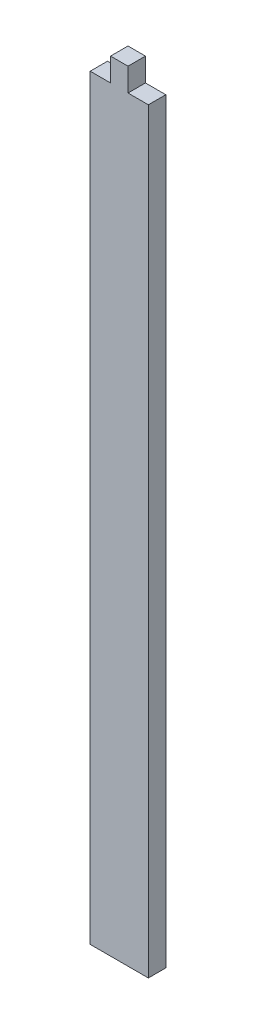
ISO-10303-21;
HEADER;
FILE_DESCRIPTION(('STEP AP214'),'2;1');
FILE_NAME('part.step','',(''),(''),'','','');
FILE_SCHEMA(('AUTOMOTIVE_DESIGN { 1 0 10303 214 1 1 1 1 }'));
ENDSEC;
DATA;
#1=APPLICATION_CONTEXT('core data for automotive mechanical design processes');
#2=APPLICATION_PROTOCOL_DEFINITION('international standard','automotive_design',2000,#1);
#3=PRODUCT_CONTEXT('',#1,'mechanical');
#4=PRODUCT('Part','Part','',(#3));
#5=PRODUCT_RELATED_PRODUCT_CATEGORY('part','',(#4));
#6=PRODUCT_DEFINITION_FORMATION('','',#4);
#7=PRODUCT_DEFINITION_CONTEXT('part definition',#1,'design');
#8=PRODUCT_DEFINITION('design','',#6,#7);
#9=PRODUCT_DEFINITION_SHAPE('','',#8);
#10=(LENGTH_UNIT() NAMED_UNIT(*) SI_UNIT(.MILLI.,.METRE.));
#11=(NAMED_UNIT(*) PLANE_ANGLE_UNIT() SI_UNIT($,.RADIAN.));
#12=(NAMED_UNIT(*) SI_UNIT($,.STERADIAN.) SOLID_ANGLE_UNIT());
#13=UNCERTAINTY_MEASURE_WITH_UNIT(LENGTH_MEASURE(1.E-05),#10,'distance_accuracy_value','');
#14=(GEOMETRIC_REPRESENTATION_CONTEXT(3) GLOBAL_UNCERTAINTY_ASSIGNED_CONTEXT((#13)) GLOBAL_UNIT_ASSIGNED_CONTEXT((#10,
#11,#12)) REPRESENTATION_CONTEXT('',''));
#15=CARTESIAN_POINT('',(0.,0.,0.));
#16=DIRECTION('',(0.,0.,1.));
#17=DIRECTION('',(1.,0.,0.));
#18=AXIS2_PLACEMENT_3D('',#15,#16,#17);
#19=CARTESIAN_POINT('',(4.99999999999999,64.9999999999999,1.5));
#20=DIRECTION('',(-1.,0.,0.));
#21=DIRECTION('',(0.,-1.,0.));
#22=AXIS2_PLACEMENT_3D('',#19,#20,#21);
#23=PLANE('',#22);
#24=DIRECTION('',(0.,1.,0.));
#25=VECTOR('',#24,1.);
#26=CARTESIAN_POINT('',(4.99999999999999,64.9999999999999,-1.5));
#27=LINE('',#26,#25);
#28=CARTESIAN_POINT('',(5.00000000000001,-65.0000000000001,-1.5));
#29=VERTEX_POINT('',#28);
#30=CARTESIAN_POINT('',(4.99999999999999,64.9999999999999,-1.5));
#31=VERTEX_POINT('',#30);
#32=EDGE_CURVE('E129',#29,#31,#27,.T.);
#33=ORIENTED_EDGE('',*,*,#32,.T.);
#34=DIRECTION('',(0.,0.,-1.));
#35=VECTOR('',#34,1.);
#36=CARTESIAN_POINT('',(4.99999999999999,64.9999999999999,1.5));
#37=LINE('',#36,#35);
#38=CARTESIAN_POINT('',(4.99999999999999,64.9999999999999,1.5));
#39=VERTEX_POINT('',#38);
#40=EDGE_CURVE('E11',#39,#31,#37,.T.);
#41=ORIENTED_EDGE('',*,*,#40,.F.);
#42=DIRECTION('',(0.,1.,0.));
#43=VECTOR('',#42,1.);
#44=CARTESIAN_POINT('',(4.99999999999999,64.9999999999999,1.5));
#45=LINE('',#44,#43);
#46=CARTESIAN_POINT('',(5.00000000000001,-65.0000000000001,1.5));
#47=VERTEX_POINT('',#46);
#48=EDGE_CURVE('E143',#47,#39,#45,.T.);
#49=ORIENTED_EDGE('',*,*,#48,.F.);
#50=DIRECTION('',(0.,0.,-1.));
#51=VECTOR('',#50,1.);
#52=CARTESIAN_POINT('',(5.00000000000001,-65.0000000000001,1.5));
#53=LINE('',#52,#51);
#54=EDGE_CURVE('E125',#47,#29,#53,.T.);
#55=ORIENTED_EDGE('',*,*,#54,.T.);
#56=EDGE_LOOP('',(#33,#41,#49,#55));
#57=FACE_BOUND('',#56,.T.);
#58=ADVANCED_FACE('F33',(#57),#23,.F.);
#59=CARTESIAN_POINT('',(1.49999999999999,64.9999999999999,1.5));
#60=DIRECTION('',(0.,-1.,0.));
#61=DIRECTION('',(0.,0.,-1.));
#62=AXIS2_PLACEMENT_3D('',#59,#60,#61);
#63=PLANE('',#62);
#64=DIRECTION('',(-1.,0.,0.));
#65=VECTOR('',#64,1.);
#66=CARTESIAN_POINT('',(1.49999999999999,64.9999999999999,-1.5));
#67=LINE('',#66,#65);
#68=CARTESIAN_POINT('',(1.49999999999999,64.9999999999999,-1.5));
#69=VERTEX_POINT('',#68);
#70=EDGE_CURVE('E132',#31,#69,#67,.T.);
#71=ORIENTED_EDGE('',*,*,#70,.T.);
#72=DIRECTION('',(0.,0.,-1.));
#73=VECTOR('',#72,1.);
#74=CARTESIAN_POINT('',(1.49999999999999,64.9999999999999,1.5));
#75=LINE('',#74,#73);
#76=CARTESIAN_POINT('',(1.49999999999999,64.9999999999999,1.5));
#77=VERTEX_POINT('',#76);
#78=EDGE_CURVE('E41',#77,#69,#75,.T.);
#79=ORIENTED_EDGE('',*,*,#78,.F.);
#80=DIRECTION('',(-1.,0.,0.));
#81=VECTOR('',#80,1.);
#82=CARTESIAN_POINT('',(1.49999999999999,64.9999999999999,1.5));
#83=LINE('',#82,#81);
#84=EDGE_CURVE('E92',#39,#77,#83,.T.);
#85=ORIENTED_EDGE('',*,*,#84,.F.);
#86=ORIENTED_EDGE('',*,*,#40,.T.);
#87=EDGE_LOOP('',(#71,#79,#85,#86));
#88=FACE_BOUND('',#87,.T.);
#89=ADVANCED_FACE('F178',(#88),#63,.F.);
#90=CARTESIAN_POINT('',(1.49999999999999,64.9999999999999,1.5));
#91=DIRECTION('',(-1.,0.,0.));
#92=DIRECTION('',(0.,0.,1.));
#93=AXIS2_PLACEMENT_3D('',#90,#91,#92);
#94=PLANE('',#93);
#95=DIRECTION('',(0.,1.,0.));
#96=VECTOR('',#95,1.);
#97=CARTESIAN_POINT('',(1.49999999999999,64.9999999999999,-1.5));
#98=LINE('',#97,#96);
#99=CARTESIAN_POINT('',(1.49999999999999,68.9999999999999,-1.5));
#100=VERTEX_POINT('',#99);
#101=EDGE_CURVE('E134',#69,#100,#98,.T.);
#102=ORIENTED_EDGE('',*,*,#101,.T.);
#103=DIRECTION('',(0.,0.,-1.));
#104=VECTOR('',#103,1.);
#105=CARTESIAN_POINT('',(1.49999999999999,68.9999999999999,1.5));
#106=LINE('',#105,#104);
#107=CARTESIAN_POINT('',(1.49999999999999,68.9999999999999,1.5));
#108=VERTEX_POINT('',#107);
#109=EDGE_CURVE('E150',#108,#100,#106,.T.);
#110=ORIENTED_EDGE('',*,*,#109,.F.);
#111=DIRECTION('',(0.,1.,0.));
#112=VECTOR('',#111,1.);
#113=CARTESIAN_POINT('',(1.49999999999999,64.9999999999999,1.5));
#114=LINE('',#113,#112);
#115=EDGE_CURVE('E158',#77,#108,#114,.T.);
#116=ORIENTED_EDGE('',*,*,#115,.F.);
#117=ORIENTED_EDGE('',*,*,#78,.T.);
#118=EDGE_LOOP('',(#102,#110,#116,#117));
#119=FACE_BOUND('',#118,.T.);
#120=ADVANCED_FACE('F156',(#119),#94,.F.);
#121=CARTESIAN_POINT('',(-1.50000000000001,68.9999999999999,1.5));
#122=DIRECTION('',(0.,-1.,0.));
#123=DIRECTION('',(0.,0.,-1.));
#124=AXIS2_PLACEMENT_3D('',#121,#122,#123);
#125=PLANE('',#124);
#126=DIRECTION('',(-1.,0.,0.));
#127=VECTOR('',#126,1.);
#128=CARTESIAN_POINT('',(-1.50000000000001,68.9999999999999,-1.5));
#129=LINE('',#128,#127);
#130=CARTESIAN_POINT('',(-1.50000000000001,68.9999999999999,-1.5));
#131=VERTEX_POINT('',#130);
#132=EDGE_CURVE('E136',#100,#131,#129,.T.);
#133=ORIENTED_EDGE('',*,*,#132,.T.);
#134=DIRECTION('',(0.,0.,-1.));
#135=VECTOR('',#134,1.);
#136=CARTESIAN_POINT('',(-1.50000000000001,68.9999999999999,1.5));
#137=LINE('',#136,#135);
#138=CARTESIAN_POINT('',(-1.50000000000001,68.9999999999999,1.5));
#139=VERTEX_POINT('',#138);
#140=EDGE_CURVE('E147',#139,#131,#137,.T.);
#141=ORIENTED_EDGE('',*,*,#140,.F.);
#142=DIRECTION('',(-1.,0.,0.));
#143=VECTOR('',#142,1.);
#144=CARTESIAN_POINT('',(-1.50000000000001,68.9999999999999,1.5));
#145=LINE('',#144,#143);
#146=EDGE_CURVE('E170',#108,#139,#145,.T.);
#147=ORIENTED_EDGE('',*,*,#146,.F.);
#148=ORIENTED_EDGE('',*,*,#109,.T.);
#149=EDGE_LOOP('',(#133,#141,#147,#148));
#150=FACE_BOUND('',#149,.T.);
#151=ADVANCED_FACE('F166',(#150),#125,.F.);
#152=CARTESIAN_POINT('',(-1.50000000000001,64.9999999999999,1.5));
#153=DIRECTION('',(1.,0.,0.));
#154=DIRECTION('',(0.,0.,-1.));
#155=AXIS2_PLACEMENT_3D('',#152,#153,#154);
#156=PLANE('',#155);
#157=DIRECTION('',(0.,-1.,0.));
#158=VECTOR('',#157,1.);
#159=CARTESIAN_POINT('',(-1.50000000000001,64.9999999999999,-1.5));
#160=LINE('',#159,#158);
#161=CARTESIAN_POINT('',(-1.50000000000001,64.9999999999999,-1.5));
#162=VERTEX_POINT('',#161);
#163=EDGE_CURVE('E138',#131,#162,#160,.T.);
#164=ORIENTED_EDGE('',*,*,#163,.T.);
#165=DIRECTION('',(0.,0.,-1.));
#166=VECTOR('',#165,1.);
#167=CARTESIAN_POINT('',(-1.50000000000001,64.9999999999999,1.5));
#168=LINE('',#167,#166);
#169=CARTESIAN_POINT('',(-1.50000000000001,64.9999999999999,1.5));
#170=VERTEX_POINT('',#169);
#171=EDGE_CURVE('E120',#170,#162,#168,.T.);
#172=ORIENTED_EDGE('',*,*,#171,.F.);
#173=DIRECTION('',(0.,-1.,0.));
#174=VECTOR('',#173,1.);
#175=CARTESIAN_POINT('',(-1.50000000000001,64.9999999999999,1.5));
#176=LINE('',#175,#174);
#177=EDGE_CURVE('E111',#139,#170,#176,.T.);
#178=ORIENTED_EDGE('',*,*,#177,.F.);
#179=ORIENTED_EDGE('',*,*,#140,.T.);
#180=EDGE_LOOP('',(#164,#172,#178,#179));
#181=FACE_BOUND('',#180,.T.);
#182=ADVANCED_FACE('F169',(#181),#156,.F.);
#183=CARTESIAN_POINT('',(-5.00000000000001,64.9999999999999,1.5));
#184=DIRECTION('',(0.,-1.,0.));
#185=DIRECTION('',(0.,0.,-1.));
#186=AXIS2_PLACEMENT_3D('',#183,#184,#185);
#187=PLANE('',#186);
#188=DIRECTION('',(-1.,0.,0.));
#189=VECTOR('',#188,1.);
#190=CARTESIAN_POINT('',(-5.00000000000001,64.9999999999999,-1.5));
#191=LINE('',#190,#189);
#192=CARTESIAN_POINT('',(-5.00000000000001,64.9999999999999,-1.5));
#193=VERTEX_POINT('',#192);
#194=EDGE_CURVE('E119',#162,#193,#191,.T.);
#195=ORIENTED_EDGE('',*,*,#194,.T.);
#196=DIRECTION('',(0.,0.,-1.));
#197=VECTOR('',#196,1.);
#198=CARTESIAN_POINT('',(-5.00000000000001,64.9999999999999,1.5));
#199=LINE('',#198,#197);
#200=CARTESIAN_POINT('',(-5.00000000000001,64.9999999999999,1.5));
#201=VERTEX_POINT('',#200);
#202=EDGE_CURVE('E116',#201,#193,#199,.T.);
#203=ORIENTED_EDGE('',*,*,#202,.F.);
#204=DIRECTION('',(-1.,0.,0.));
#205=VECTOR('',#204,1.);
#206=CARTESIAN_POINT('',(-5.00000000000001,64.9999999999999,1.5));
#207=LINE('',#206,#205);
#208=EDGE_CURVE('E105',#170,#201,#207,.T.);
#209=ORIENTED_EDGE('',*,*,#208,.F.);
#210=ORIENTED_EDGE('',*,*,#171,.T.);
#211=EDGE_LOOP('',(#195,#203,#209,#210));
#212=FACE_BOUND('',#211,.T.);
#213=ADVANCED_FACE('F117',(#212),#187,.F.);
#214=CARTESIAN_POINT('',(-5.00000000000001,64.9999999999999,1.5));
#215=DIRECTION('',(1.,0.,0.));
#216=DIRECTION('',(0.,1.,0.));
#217=AXIS2_PLACEMENT_3D('',#214,#215,#216);
#218=PLANE('',#217);
#219=DIRECTION('',(0.,-1.,0.));
#220=VECTOR('',#219,1.);
#221=CARTESIAN_POINT('',(-5.00000000000001,64.9999999999999,-1.5));
#222=LINE('',#221,#220);
#223=CARTESIAN_POINT('',(-4.99999999999999,-65.0000000000001,-1.5));
#224=VERTEX_POINT('',#223);
#225=EDGE_CURVE('E78',#193,#224,#222,.T.);
#226=ORIENTED_EDGE('',*,*,#225,.T.);
#227=DIRECTION('',(0.,0.,-1.));
#228=VECTOR('',#227,1.);
#229=CARTESIAN_POINT('',(-4.99999999999999,-65.0000000000001,1.5));
#230=LINE('',#229,#228);
#231=CARTESIAN_POINT('',(-4.99999999999999,-65.0000000000001,1.5));
#232=VERTEX_POINT('',#231);
#233=EDGE_CURVE('E121',#232,#224,#230,.T.);
#234=ORIENTED_EDGE('',*,*,#233,.F.);
#235=DIRECTION('',(0.,-1.,0.));
#236=VECTOR('',#235,1.);
#237=CARTESIAN_POINT('',(-5.00000000000001,64.9999999999999,1.5));
#238=LINE('',#237,#236);
#239=EDGE_CURVE('E109',#201,#232,#238,.T.);
#240=ORIENTED_EDGE('',*,*,#239,.F.);
#241=ORIENTED_EDGE('',*,*,#202,.T.);
#242=EDGE_LOOP('',(#226,#234,#240,#241));
#243=FACE_BOUND('',#242,.T.);
#244=ADVANCED_FACE('F123',(#243),#218,.F.);
#245=CARTESIAN_POINT('',(-4.99999999999999,-65.0000000000001,1.5));
#246=DIRECTION('',(0.,1.,0.));
#247=DIRECTION('',(0.,0.,1.));
#248=AXIS2_PLACEMENT_3D('',#245,#246,#247);
#249=PLANE('',#248);
#250=DIRECTION('',(1.,0.,0.));
#251=VECTOR('',#250,1.);
#252=CARTESIAN_POINT('',(-4.99999999999999,-65.0000000000001,-1.5));
#253=LINE('',#252,#251);
#254=EDGE_CURVE('E84',#224,#29,#253,.T.);
#255=ORIENTED_EDGE('',*,*,#254,.T.);
#256=ORIENTED_EDGE('',*,*,#54,.F.);
#257=DIRECTION('',(1.,0.,0.));
#258=VECTOR('',#257,1.);
#259=CARTESIAN_POINT('',(-4.99999999999999,-65.0000000000001,1.5));
#260=LINE('',#259,#258);
#261=EDGE_CURVE('E49',#232,#47,#260,.T.);
#262=ORIENTED_EDGE('',*,*,#261,.F.);
#263=ORIENTED_EDGE('',*,*,#233,.T.);
#264=EDGE_LOOP('',(#255,#256,#262,#263));
#265=FACE_BOUND('',#264,.T.);
#266=ADVANCED_FACE('F194',(#265),#249,.F.);
#267=CARTESIAN_POINT('',(0.,0.,1.5));
#268=DIRECTION('',(0.,0.,1.));
#269=DIRECTION('',(1.,0.,0.));
#270=AXIS2_PLACEMENT_3D('',#267,#268,#269);
#271=PLANE('',#270);
#272=ORIENTED_EDGE('',*,*,#48,.T.);
#273=ORIENTED_EDGE('',*,*,#84,.T.);
#274=ORIENTED_EDGE('',*,*,#115,.T.);
#275=ORIENTED_EDGE('',*,*,#146,.T.);
#276=ORIENTED_EDGE('',*,*,#177,.T.);
#277=ORIENTED_EDGE('',*,*,#208,.T.);
#278=ORIENTED_EDGE('',*,*,#239,.T.);
#279=ORIENTED_EDGE('',*,*,#261,.T.);
#280=EDGE_LOOP('',(#272,#273,#274,#275,#276,#277,#278,#279));
#281=FACE_BOUND('',#280,.T.);
#282=ADVANCED_FACE('F107',(#281),#271,.T.);
#283=CARTESIAN_POINT('',(0.,0.,-1.5));
#284=DIRECTION('',(0.,0.,1.));
#285=DIRECTION('',(1.,0.,0.));
#286=AXIS2_PLACEMENT_3D('',#283,#284,#285);
#287=PLANE('',#286);
#288=ORIENTED_EDGE('',*,*,#32,.F.);
#289=ORIENTED_EDGE('',*,*,#254,.F.);
#290=ORIENTED_EDGE('',*,*,#225,.F.);
#291=ORIENTED_EDGE('',*,*,#194,.F.);
#292=ORIENTED_EDGE('',*,*,#163,.F.);
#293=ORIENTED_EDGE('',*,*,#132,.F.);
#294=ORIENTED_EDGE('',*,*,#101,.F.);
#295=ORIENTED_EDGE('',*,*,#70,.F.);
#296=EDGE_LOOP('',(#288,#289,#290,#291,#292,#293,#294,#295));
#297=FACE_BOUND('',#296,.T.);
#298=ADVANCED_FACE('F162',(#297),#287,.F.);
#299=CLOSED_SHELL('',(#58,#89,#120,#151,#182,#213,#244,#266,#282,#298));
#300=MANIFOLD_SOLID_BREP('B2',#299);
#301=ADVANCED_BREP_SHAPE_REPRESENTATION('',(#18,#300),#14);
#302=SHAPE_DEFINITION_REPRESENTATION(#9,#301);
ENDSEC;
END-ISO-10303-21;
